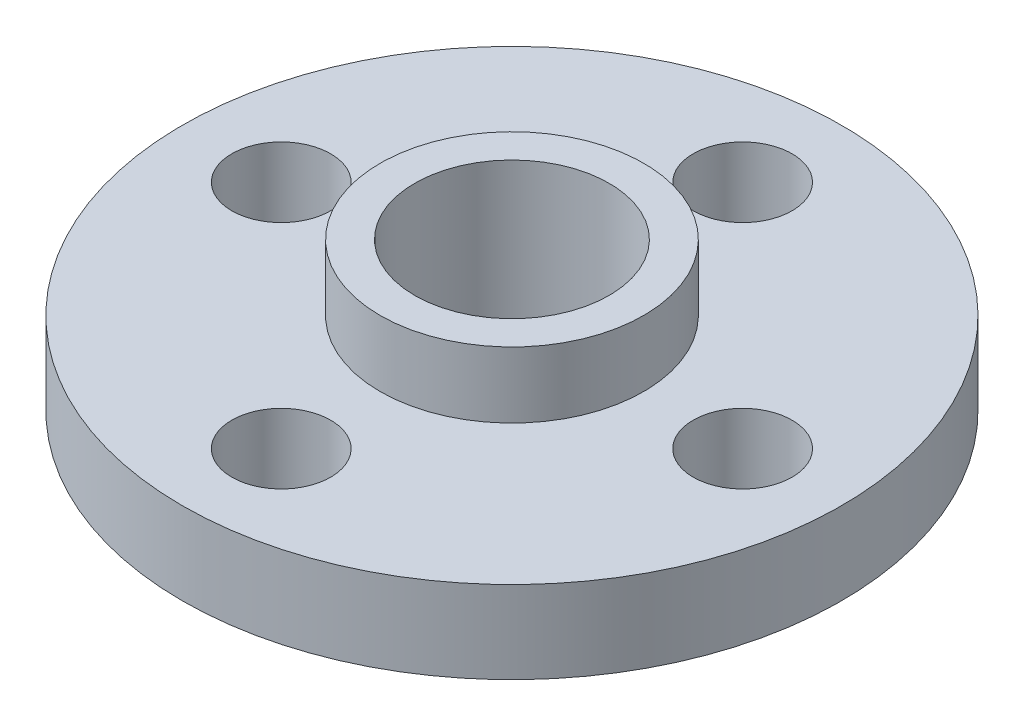
ISO-10303-21;
HEADER;
FILE_DESCRIPTION(('STEP AP214'),'2;1');
FILE_NAME('part.step','',(''),(''),'','','');
FILE_SCHEMA(('AUTOMOTIVE_DESIGN { 1 0 10303 214 1 1 1 1 }'));
ENDSEC;
DATA;
#1=APPLICATION_CONTEXT('core data for automotive mechanical design processes');
#2=APPLICATION_PROTOCOL_DEFINITION('international standard','automotive_design',2000,#1);
#3=PRODUCT_CONTEXT('',#1,'mechanical');
#4=PRODUCT('Part','Part','',(#3));
#5=PRODUCT_RELATED_PRODUCT_CATEGORY('part','',(#4));
#6=PRODUCT_DEFINITION_FORMATION('','',#4);
#7=PRODUCT_DEFINITION_CONTEXT('part definition',#1,'design');
#8=PRODUCT_DEFINITION('design','',#6,#7);
#9=PRODUCT_DEFINITION_SHAPE('','',#8);
#10=(LENGTH_UNIT() NAMED_UNIT(*) SI_UNIT(.MILLI.,.METRE.));
#11=(NAMED_UNIT(*) PLANE_ANGLE_UNIT() SI_UNIT($,.RADIAN.));
#12=(NAMED_UNIT(*) SI_UNIT($,.STERADIAN.) SOLID_ANGLE_UNIT());
#13=UNCERTAINTY_MEASURE_WITH_UNIT(LENGTH_MEASURE(1.E-05),#10,'distance_accuracy_value','');
#14=(GEOMETRIC_REPRESENTATION_CONTEXT(3) GLOBAL_UNCERTAINTY_ASSIGNED_CONTEXT((#13)) GLOBAL_UNIT_ASSIGNED_CONTEXT((#10,
#11,#12)) REPRESENTATION_CONTEXT('',''));
#15=CARTESIAN_POINT('',(0.,0.,0.));
#16=DIRECTION('',(0.,0.,1.));
#17=DIRECTION('',(1.,0.,0.));
#18=AXIS2_PLACEMENT_3D('',#15,#16,#17);
#19=CARTESIAN_POINT('',(0.,2.5,0.));
#20=DIRECTION('',(0.,1.,0.));
#21=DIRECTION('',(0.,0.,1.));
#22=AXIS2_PLACEMENT_3D('',#19,#20,#21);
#23=PLANE('',#22);
#24=CARTESIAN_POINT('',(0.,2.5,7.));
#25=DIRECTION('',(0.,1.,0.));
#26=DIRECTION('',(0.,0.,1.));
#27=AXIS2_PLACEMENT_3D('',#24,#25,#26);
#28=CIRCLE('',#27,1.5);
#29=CARTESIAN_POINT('',(0.,2.5,8.5));
#30=VERTEX_POINT('',#29);
#31=EDGE_CURVE('E54',#30,#30,#28,.T.);
#32=ORIENTED_EDGE('',*,*,#31,.F.);
#33=EDGE_LOOP('',(#32));
#34=FACE_BOUND('',#33,.T.);
#35=CARTESIAN_POINT('',(-7.,2.5,0.));
#36=DIRECTION('',(0.,1.,0.));
#37=DIRECTION('',(0.,0.,1.));
#38=AXIS2_PLACEMENT_3D('',#35,#36,#37);
#39=CIRCLE('',#38,1.5);
#40=CARTESIAN_POINT('',(-7.,2.5,1.5));
#41=VERTEX_POINT('',#40);
#42=EDGE_CURVE('E43',#41,#41,#39,.T.);
#43=ORIENTED_EDGE('',*,*,#42,.F.);
#44=EDGE_LOOP('',(#43));
#45=FACE_BOUND('',#44,.T.);
#46=CARTESIAN_POINT('',(0.,2.5,0.));
#47=DIRECTION('',(0.,1.,0.));
#48=DIRECTION('',(0.,0.,1.));
#49=AXIS2_PLACEMENT_3D('',#46,#47,#48);
#50=CIRCLE('',#49,10.);
#51=CARTESIAN_POINT('',(0.,2.5,10.));
#52=VERTEX_POINT('',#51);
#53=EDGE_CURVE('E10',#52,#52,#50,.T.);
#54=ORIENTED_EDGE('',*,*,#53,.T.);
#55=EDGE_LOOP('',(#54));
#56=FACE_BOUND('',#55,.T.);
#57=CARTESIAN_POINT('',(0.,2.5,-7.));
#58=DIRECTION('',(0.,1.,0.));
#59=DIRECTION('',(0.,0.,1.));
#60=AXIS2_PLACEMENT_3D('',#57,#58,#59);
#61=CIRCLE('',#60,1.5);
#62=CARTESIAN_POINT('',(0.,2.5,-5.5));
#63=VERTEX_POINT('',#62);
#64=EDGE_CURVE('E48',#63,#63,#61,.T.);
#65=ORIENTED_EDGE('',*,*,#64,.F.);
#66=EDGE_LOOP('',(#65));
#67=FACE_BOUND('',#66,.T.);
#68=CARTESIAN_POINT('',(7.,2.5,0.));
#69=DIRECTION('',(0.,1.,0.));
#70=DIRECTION('',(0.,0.,1.));
#71=AXIS2_PLACEMENT_3D('',#68,#69,#70);
#72=CIRCLE('',#71,1.5);
#73=CARTESIAN_POINT('',(7.,2.5,1.5));
#74=VERTEX_POINT('',#73);
#75=EDGE_CURVE('E60',#74,#74,#72,.T.);
#76=ORIENTED_EDGE('',*,*,#75,.F.);
#77=EDGE_LOOP('',(#76));
#78=FACE_BOUND('',#77,.T.);
#79=CARTESIAN_POINT('',(0.,2.5,0.));
#80=DIRECTION('',(0.,1.,0.));
#81=DIRECTION('',(0.,0.,1.));
#82=AXIS2_PLACEMENT_3D('',#79,#80,#81);
#83=CIRCLE('',#82,4.);
#84=CARTESIAN_POINT('',(0.,2.5,4.));
#85=VERTEX_POINT('',#84);
#86=EDGE_CURVE('E72',#85,#85,#83,.T.);
#87=ORIENTED_EDGE('',*,*,#86,.F.);
#88=EDGE_LOOP('',(#87));
#89=FACE_BOUND('',#88,.T.);
#90=ADVANCED_FACE('F32',(#34,#45,#56,#67,#78,#89),#23,.T.);
#91=CARTESIAN_POINT('',(0.,0.,0.));
#92=DIRECTION('',(0.,1.,0.));
#93=DIRECTION('',(0.,0.,1.));
#94=AXIS2_PLACEMENT_3D('',#91,#92,#93);
#95=PLANE('',#94);
#96=CARTESIAN_POINT('',(0.,0.,0.));
#97=DIRECTION('',(0.,1.,0.));
#98=DIRECTION('',(0.,0.,1.));
#99=AXIS2_PLACEMENT_3D('',#96,#97,#98);
#100=CIRCLE('',#99,10.);
#101=CARTESIAN_POINT('',(0.,0.,10.));
#102=VERTEX_POINT('',#101);
#103=EDGE_CURVE('E36',#102,#102,#100,.T.);
#104=ORIENTED_EDGE('',*,*,#103,.F.);
#105=EDGE_LOOP('',(#104));
#106=FACE_BOUND('',#105,.T.);
#107=CARTESIAN_POINT('',(-7.,0.,0.));
#108=DIRECTION('',(0.,1.,0.));
#109=DIRECTION('',(0.,0.,1.));
#110=AXIS2_PLACEMENT_3D('',#107,#108,#109);
#111=CIRCLE('',#110,1.5);
#112=CARTESIAN_POINT('',(-7.,0.,1.5));
#113=VERTEX_POINT('',#112);
#114=EDGE_CURVE('E45',#113,#113,#111,.T.);
#115=ORIENTED_EDGE('',*,*,#114,.T.);
#116=EDGE_LOOP('',(#115));
#117=FACE_BOUND('',#116,.T.);
#118=CARTESIAN_POINT('',(0.,0.,-7.));
#119=DIRECTION('',(0.,1.,0.));
#120=DIRECTION('',(0.,0.,1.));
#121=AXIS2_PLACEMENT_3D('',#118,#119,#120);
#122=CIRCLE('',#121,1.5);
#123=CARTESIAN_POINT('',(0.,0.,-5.5));
#124=VERTEX_POINT('',#123);
#125=EDGE_CURVE('E51',#124,#124,#122,.T.);
#126=ORIENTED_EDGE('',*,*,#125,.T.);
#127=EDGE_LOOP('',(#126));
#128=FACE_BOUND('',#127,.T.);
#129=CARTESIAN_POINT('',(0.,0.,7.));
#130=DIRECTION('',(0.,1.,0.));
#131=DIRECTION('',(0.,0.,1.));
#132=AXIS2_PLACEMENT_3D('',#129,#130,#131);
#133=CIRCLE('',#132,1.5);
#134=CARTESIAN_POINT('',(0.,0.,8.5));
#135=VERTEX_POINT('',#134);
#136=EDGE_CURVE('E57',#135,#135,#133,.T.);
#137=ORIENTED_EDGE('',*,*,#136,.T.);
#138=EDGE_LOOP('',(#137));
#139=FACE_BOUND('',#138,.T.);
#140=CARTESIAN_POINT('',(7.,0.,0.));
#141=DIRECTION('',(0.,1.,0.));
#142=DIRECTION('',(0.,0.,1.));
#143=AXIS2_PLACEMENT_3D('',#140,#141,#142);
#144=CIRCLE('',#143,1.5);
#145=CARTESIAN_POINT('',(7.,0.,1.5));
#146=VERTEX_POINT('',#145);
#147=EDGE_CURVE('E63',#146,#146,#144,.T.);
#148=ORIENTED_EDGE('',*,*,#147,.T.);
#149=EDGE_LOOP('',(#148));
#150=FACE_BOUND('',#149,.T.);
#151=CARTESIAN_POINT('',(0.,0.,0.));
#152=DIRECTION('',(0.,1.,0.));
#153=DIRECTION('',(0.,0.,1.));
#154=AXIS2_PLACEMENT_3D('',#151,#152,#153);
#155=CIRCLE('',#154,2.95);
#156=CARTESIAN_POINT('',(0.,0.,2.95));
#157=VERTEX_POINT('',#156);
#158=EDGE_CURVE('E66',#157,#157,#155,.T.);
#159=ORIENTED_EDGE('',*,*,#158,.T.);
#160=EDGE_LOOP('',(#159));
#161=FACE_BOUND('',#160,.T.);
#162=ADVANCED_FACE('F98',(#106,#117,#128,#139,#150,#161),#95,.F.);
#163=CARTESIAN_POINT('',(0.,2.5,0.));
#164=DIRECTION('',(0.,-1.,0.));
#165=DIRECTION('',(0.,0.,-1.));
#166=AXIS2_PLACEMENT_3D('',#163,#164,#165);
#167=CYLINDRICAL_SURFACE('',#166,10.);
#168=ORIENTED_EDGE('',*,*,#53,.F.);
#169=EDGE_LOOP('',(#168));
#170=FACE_BOUND('',#169,.T.);
#171=ORIENTED_EDGE('',*,*,#103,.T.);
#172=EDGE_LOOP('',(#171));
#173=FACE_BOUND('',#172,.T.);
#174=ADVANCED_FACE('F34',(#170,#173),#167,.T.);
#175=CARTESIAN_POINT('',(-7.,2.5,0.));
#176=DIRECTION('',(0.,-1.,0.));
#177=DIRECTION('',(0.,0.,-1.));
#178=AXIS2_PLACEMENT_3D('',#175,#176,#177);
#179=CYLINDRICAL_SURFACE('',#178,1.5);
#180=ORIENTED_EDGE('',*,*,#42,.T.);
#181=EDGE_LOOP('',(#180));
#182=FACE_BOUND('',#181,.T.);
#183=ORIENTED_EDGE('',*,*,#114,.F.);
#184=EDGE_LOOP('',(#183));
#185=FACE_BOUND('',#184,.T.);
#186=ADVANCED_FACE('F108',(#182,#185),#179,.F.);
#187=CARTESIAN_POINT('',(0.,2.5,-7.));
#188=DIRECTION('',(0.,-1.,0.));
#189=DIRECTION('',(0.,0.,-1.));
#190=AXIS2_PLACEMENT_3D('',#187,#188,#189);
#191=CYLINDRICAL_SURFACE('',#190,1.5);
#192=ORIENTED_EDGE('',*,*,#64,.T.);
#193=EDGE_LOOP('',(#192));
#194=FACE_BOUND('',#193,.T.);
#195=ORIENTED_EDGE('',*,*,#125,.F.);
#196=EDGE_LOOP('',(#195));
#197=FACE_BOUND('',#196,.T.);
#198=ADVANCED_FACE('F111',(#194,#197),#191,.F.);
#199=CARTESIAN_POINT('',(0.,2.5,7.));
#200=DIRECTION('',(0.,-1.,0.));
#201=DIRECTION('',(0.,0.,-1.));
#202=AXIS2_PLACEMENT_3D('',#199,#200,#201);
#203=CYLINDRICAL_SURFACE('',#202,1.5);
#204=ORIENTED_EDGE('',*,*,#31,.T.);
#205=EDGE_LOOP('',(#204));
#206=FACE_BOUND('',#205,.T.);
#207=ORIENTED_EDGE('',*,*,#136,.F.);
#208=EDGE_LOOP('',(#207));
#209=FACE_BOUND('',#208,.T.);
#210=ADVANCED_FACE('F115',(#206,#209),#203,.F.);
#211=CARTESIAN_POINT('',(7.,2.5,0.));
#212=DIRECTION('',(0.,-1.,0.));
#213=DIRECTION('',(0.,0.,-1.));
#214=AXIS2_PLACEMENT_3D('',#211,#212,#213);
#215=CYLINDRICAL_SURFACE('',#214,1.5);
#216=ORIENTED_EDGE('',*,*,#75,.T.);
#217=EDGE_LOOP('',(#216));
#218=FACE_BOUND('',#217,.T.);
#219=ORIENTED_EDGE('',*,*,#147,.F.);
#220=EDGE_LOOP('',(#219));
#221=FACE_BOUND('',#220,.T.);
#222=ADVANCED_FACE('F94',(#218,#221),#215,.F.);
#223=CARTESIAN_POINT('',(0.,2.5,0.));
#224=DIRECTION('',(0.,-1.,0.));
#225=DIRECTION('',(0.,0.,-1.));
#226=AXIS2_PLACEMENT_3D('',#223,#224,#225);
#227=CYLINDRICAL_SURFACE('',#226,2.95);
#228=ORIENTED_EDGE('',*,*,#158,.F.);
#229=EDGE_LOOP('',(#228));
#230=FACE_BOUND('',#229,.T.);
#231=CARTESIAN_POINT('',(0.,4.5,0.));
#232=DIRECTION('',(0.,1.,0.));
#233=DIRECTION('',(0.,0.,1.));
#234=AXIS2_PLACEMENT_3D('',#231,#232,#233);
#235=CIRCLE('',#234,2.95);
#236=CARTESIAN_POINT('',(0.,4.5,2.95));
#237=VERTEX_POINT('',#236);
#238=EDGE_CURVE('E75',#237,#237,#235,.T.);
#239=ORIENTED_EDGE('',*,*,#238,.T.);
#240=EDGE_LOOP('',(#239));
#241=FACE_BOUND('',#240,.T.);
#242=ADVANCED_FACE('F81',(#230,#241),#227,.F.);
#243=CARTESIAN_POINT('',(0.,4.5,0.));
#244=DIRECTION('',(0.,1.,0.));
#245=DIRECTION('',(0.,0.,1.));
#246=AXIS2_PLACEMENT_3D('',#243,#244,#245);
#247=PLANE('',#246);
#248=CARTESIAN_POINT('',(0.,4.5,0.));
#249=DIRECTION('',(0.,1.,0.));
#250=DIRECTION('',(0.,0.,1.));
#251=AXIS2_PLACEMENT_3D('',#248,#249,#250);
#252=CIRCLE('',#251,4.);
#253=CARTESIAN_POINT('',(0.,4.5,4.));
#254=VERTEX_POINT('',#253);
#255=EDGE_CURVE('E71',#254,#254,#252,.T.);
#256=ORIENTED_EDGE('',*,*,#255,.T.);
#257=EDGE_LOOP('',(#256));
#258=FACE_BOUND('',#257,.T.);
#259=ORIENTED_EDGE('',*,*,#238,.F.);
#260=EDGE_LOOP('',(#259));
#261=FACE_BOUND('',#260,.T.);
#262=ADVANCED_FACE('F83',(#258,#261),#247,.T.);
#263=CARTESIAN_POINT('',(0.,4.5,0.));
#264=DIRECTION('',(0.,-1.,0.));
#265=DIRECTION('',(0.,0.,-1.));
#266=AXIS2_PLACEMENT_3D('',#263,#264,#265);
#267=CYLINDRICAL_SURFACE('',#266,4.);
#268=ORIENTED_EDGE('',*,*,#255,.F.);
#269=EDGE_LOOP('',(#268));
#270=FACE_BOUND('',#269,.T.);
#271=ORIENTED_EDGE('',*,*,#86,.T.);
#272=EDGE_LOOP('',(#271));
#273=FACE_BOUND('',#272,.T.);
#274=ADVANCED_FACE('F85',(#270,#273),#267,.T.);
#275=CLOSED_SHELL('',(#90,#162,#174,#186,#198,#210,#222,#242,#262,#274));
#276=MANIFOLD_SOLID_BREP('B2',#275);
#277=ADVANCED_BREP_SHAPE_REPRESENTATION('',(#18,#276),#14);
#278=SHAPE_DEFINITION_REPRESENTATION(#9,#277);
ENDSEC;
END-ISO-10303-21;
